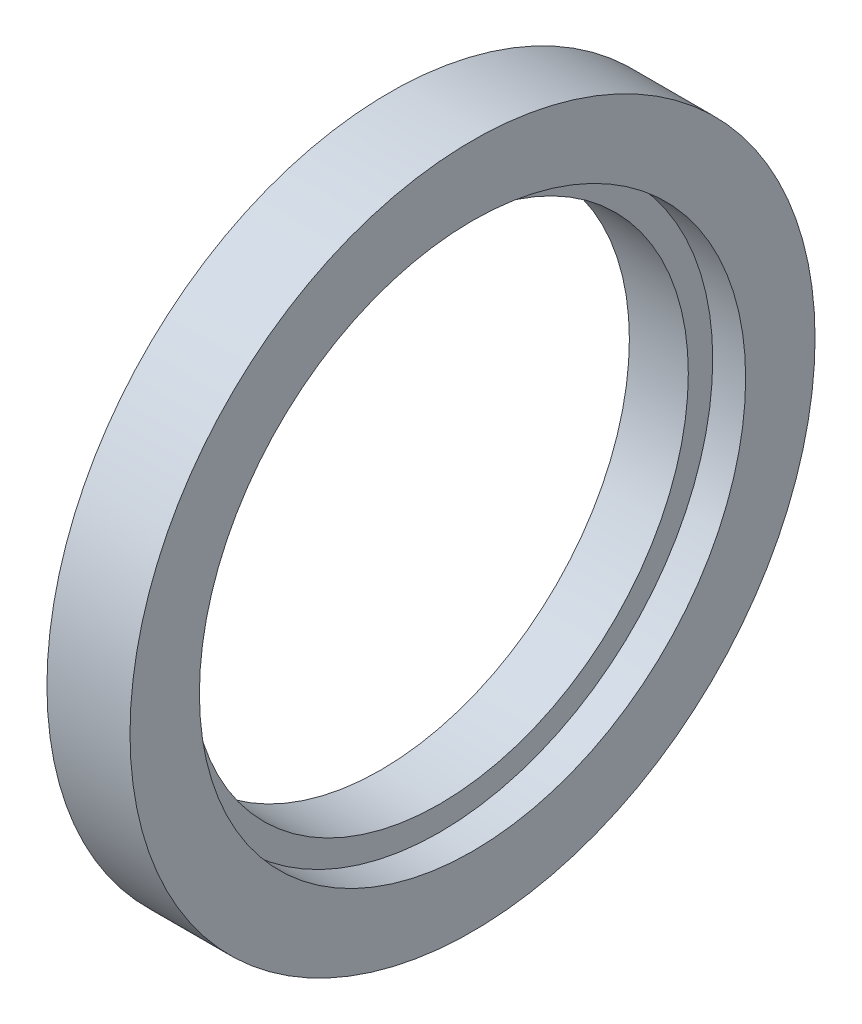
ISO-10303-21;
HEADER;
FILE_DESCRIPTION(('STEP AP214'),'2;1');
FILE_NAME('part.step','',(''),(''),'','','');
FILE_SCHEMA(('AUTOMOTIVE_DESIGN { 1 0 10303 214 1 1 1 1 }'));
ENDSEC;
DATA;
#1=APPLICATION_CONTEXT('core data for automotive mechanical design processes');
#2=APPLICATION_PROTOCOL_DEFINITION('international standard','automotive_design',2000,#1);
#3=PRODUCT_CONTEXT('',#1,'mechanical');
#4=PRODUCT('Part','Part','',(#3));
#5=PRODUCT_RELATED_PRODUCT_CATEGORY('part','',(#4));
#6=PRODUCT_DEFINITION_FORMATION('','',#4);
#7=PRODUCT_DEFINITION_CONTEXT('part definition',#1,'design');
#8=PRODUCT_DEFINITION('design','',#6,#7);
#9=PRODUCT_DEFINITION_SHAPE('','',#8);
#10=(LENGTH_UNIT() NAMED_UNIT(*) SI_UNIT(.MILLI.,.METRE.));
#11=(NAMED_UNIT(*) PLANE_ANGLE_UNIT() SI_UNIT($,.RADIAN.));
#12=(NAMED_UNIT(*) SI_UNIT($,.STERADIAN.) SOLID_ANGLE_UNIT());
#13=UNCERTAINTY_MEASURE_WITH_UNIT(LENGTH_MEASURE(1.E-05),#10,'distance_accuracy_value','');
#14=(GEOMETRIC_REPRESENTATION_CONTEXT(3) GLOBAL_UNCERTAINTY_ASSIGNED_CONTEXT((#13)) GLOBAL_UNIT_ASSIGNED_CONTEXT((#10,
#11,#12)) REPRESENTATION_CONTEXT('',''));
#15=CARTESIAN_POINT('',(0.,0.,0.));
#16=DIRECTION('',(0.,0.,1.));
#17=DIRECTION('',(1.,0.,0.));
#18=AXIS2_PLACEMENT_3D('',#15,#16,#17);
#19=CARTESIAN_POINT('',(2.0692999999999,0.,0.));
#20=DIRECTION('',(1.,0.,0.));
#21=DIRECTION('',(0.,0.,-1.));
#22=AXIS2_PLACEMENT_3D('',#19,#20,#21);
#23=CYLINDRICAL_SURFACE('',#22,17.4624999999999);
#24=CARTESIAN_POINT('',(4.13859999999983,0.,0.));
#25=DIRECTION('',(1.,0.,0.));
#26=DIRECTION('',(0.,0.,-1.));
#27=AXIS2_PLACEMENT_3D('',#24,#25,#26);
#28=CIRCLE('',#27,17.4624999999999);
#29=CARTESIAN_POINT('',(4.13859999999983,0.,-17.4624999999999));
#30=VERTEX_POINT('',#29);
#31=EDGE_CURVE('E18',#30,#30,#28,.F.);
#32=ORIENTED_EDGE('',*,*,#31,.F.);
#33=EDGE_LOOP('',(#32));
#34=FACE_BOUND('',#33,.T.);
#35=CARTESIAN_POINT('',(0.,0.,0.));
#36=DIRECTION('',(1.,0.,0.));
#37=DIRECTION('',(0.,0.,-1.));
#38=AXIS2_PLACEMENT_3D('',#35,#36,#37);
#39=CIRCLE('',#38,17.4624999999999);
#40=CARTESIAN_POINT('',(0.,0.,-17.4624999999999));
#41=VERTEX_POINT('',#40);
#42=EDGE_CURVE('E44',#41,#41,#39,.T.);
#43=ORIENTED_EDGE('',*,*,#42,.F.);
#44=EDGE_LOOP('',(#43));
#45=FACE_BOUND('',#44,.T.);
#46=ADVANCED_FACE('F15',(#34,#45),#23,.F.);
#47=CARTESIAN_POINT('',(4.13859999999983,18.3197499999999,0.));
#48=DIRECTION('',(1.,0.,0.));
#49=DIRECTION('',(0.,0.,-1.));
#50=AXIS2_PLACEMENT_3D('',#47,#48,#49);
#51=PLANE('',#50);
#52=ORIENTED_EDGE('',*,*,#31,.T.);
#53=EDGE_LOOP('',(#52));
#54=FACE_BOUND('',#53,.T.);
#55=CARTESIAN_POINT('',(4.13859999999983,0.,0.));
#56=DIRECTION('',(1.,0.,0.));
#57=DIRECTION('',(0.,0.,-1.));
#58=AXIS2_PLACEMENT_3D('',#55,#56,#57);
#59=CIRCLE('',#58,19.1769999999999);
#60=CARTESIAN_POINT('',(4.13859999999983,0.,-19.1769999999999));
#61=VERTEX_POINT('',#60);
#62=EDGE_CURVE('E42',#61,#61,#59,.T.);
#63=ORIENTED_EDGE('',*,*,#62,.T.);
#64=EDGE_LOOP('',(#63));
#65=FACE_BOUND('',#64,.T.);
#66=ADVANCED_FACE('F51',(#54,#65),#51,.T.);
#67=CARTESIAN_POINT('',(0.,19.2062500000005,0.));
#68=DIRECTION('',(-1.,0.,0.));
#69=DIRECTION('',(0.,0.,1.));
#70=AXIS2_PLACEMENT_3D('',#67,#68,#69);
#71=PLANE('',#70);
#72=ORIENTED_EDGE('',*,*,#42,.T.);
#73=EDGE_LOOP('',(#72));
#74=FACE_BOUND('',#73,.T.);
#75=CARTESIAN_POINT('',(0.,0.,0.));
#76=DIRECTION('',(1.,0.,0.));
#77=DIRECTION('',(0.,0.,-1.));
#78=AXIS2_PLACEMENT_3D('',#75,#76,#77);
#79=CIRCLE('',#78,20.950000000001);
#80=CARTESIAN_POINT('',(0.,0.,-20.950000000001));
#81=VERTEX_POINT('',#80);
#82=EDGE_CURVE('E39',#81,#81,#79,.F.);
#83=ORIENTED_EDGE('',*,*,#82,.T.);
#84=EDGE_LOOP('',(#83));
#85=FACE_BOUND('',#84,.T.);
#86=ADVANCED_FACE('F60',(#74,#85),#71,.T.);
#87=CARTESIAN_POINT('',(5.29429999999922,0.,0.));
#88=DIRECTION('',(1.,0.,0.));
#89=DIRECTION('',(0.,0.,-1.));
#90=AXIS2_PLACEMENT_3D('',#87,#88,#89);
#91=CYLINDRICAL_SURFACE('',#90,19.1769999999999);
#92=CARTESIAN_POINT('',(6.44999999999861,0.,0.));
#93=DIRECTION('',(1.,0.,0.));
#94=DIRECTION('',(0.,0.,-1.));
#95=AXIS2_PLACEMENT_3D('',#92,#93,#94);
#96=CIRCLE('',#95,19.1769999999999);
#97=CARTESIAN_POINT('',(6.44999999999861,0.,-19.1769999999999));
#98=VERTEX_POINT('',#97);
#99=EDGE_CURVE('E34',#98,#98,#96,.F.);
#100=ORIENTED_EDGE('',*,*,#99,.F.);
#101=EDGE_LOOP('',(#100));
#102=FACE_BOUND('',#101,.T.);
#103=ORIENTED_EDGE('',*,*,#62,.F.);
#104=EDGE_LOOP('',(#103));
#105=FACE_BOUND('',#104,.T.);
#106=ADVANCED_FACE('F79',(#102,#105),#91,.F.);
#107=CARTESIAN_POINT('',(-0.255000000000098,0.,0.));
#108=DIRECTION('',(1.,0.,0.));
#109=DIRECTION('',(0.,0.,-1.));
#110=AXIS2_PLACEMENT_3D('',#107,#108,#109);
#111=CYLINDRICAL_SURFACE('',#110,20.950000000001);
#112=ORIENTED_EDGE('',*,*,#82,.F.);
#113=EDGE_LOOP('',(#112));
#114=FACE_BOUND('',#113,.T.);
#115=CARTESIAN_POINT('',(-0.510000002164026,0.,0.));
#116=DIRECTION('',(1.,0.,0.));
#117=DIRECTION('',(0.,1.,0.));
#118=AXIS2_PLACEMENT_3D('',#115,#116,#117);
#119=CIRCLE('',#118,20.9500000007886);
#120=CARTESIAN_POINT('',(-0.510000002164026,20.9500000007886,0.));
#121=VERTEX_POINT('',#120);
#122=EDGE_CURVE('E27',#121,#121,#119,.T.);
#123=ORIENTED_EDGE('',*,*,#122,.F.);
#124=EDGE_LOOP('',(#123));
#125=FACE_BOUND('',#124,.T.);
#126=ADVANCED_FACE('F75',(#114,#125),#111,.F.);
#127=CARTESIAN_POINT('',(6.44999999999861,21.6135000000001,0.));
#128=DIRECTION('',(1.,0.,0.));
#129=DIRECTION('',(0.,0.,-1.));
#130=AXIS2_PLACEMENT_3D('',#127,#128,#129);
#131=PLANE('',#130);
#132=ORIENTED_EDGE('',*,*,#99,.T.);
#133=EDGE_LOOP('',(#132));
#134=FACE_BOUND('',#133,.T.);
#135=CARTESIAN_POINT('',(6.44999999999861,0.,0.));
#136=DIRECTION('',(1.,0.,0.));
#137=DIRECTION('',(0.,0.,-1.));
#138=AXIS2_PLACEMENT_3D('',#135,#136,#137);
#139=CIRCLE('',#138,24.0500000000003);
#140=CARTESIAN_POINT('',(6.44999999999861,0.,-24.0500000000003));
#141=VERTEX_POINT('',#140);
#142=EDGE_CURVE('E22',#141,#141,#139,.F.);
#143=ORIENTED_EDGE('',*,*,#142,.F.);
#144=EDGE_LOOP('',(#143));
#145=FACE_BOUND('',#144,.T.);
#146=ADVANCED_FACE('F68',(#134,#145),#131,.T.);
#147=CARTESIAN_POINT('',(0.618307728388946,0.,0.));
#148=DIRECTION('',(1.,0.,0.));
#149=DIRECTION('',(0.,0.,-1.));
#150=AXIS2_PLACEMENT_3D('',#147,#148,#149);
#151=CONICAL_SURFACE('',#150,24.0499999992128,1.22173047499991);
#152=ORIENTED_EDGE('',*,*,#122,.T.);
#153=EDGE_LOOP('',(#152));
#154=FACE_BOUND('',#153,.T.);
#155=CARTESIAN_POINT('',(0.618307726225102,0.,0.));
#156=DIRECTION('',(1.,0.,0.));
#157=DIRECTION('',(0.,0.,-1.));
#158=AXIS2_PLACEMENT_3D('',#155,#156,#157);
#159=CIRCLE('',#158,24.0500000000003);
#160=CARTESIAN_POINT('',(0.618307726225102,0.,-24.0500000000003));
#161=VERTEX_POINT('',#160);
#162=EDGE_CURVE('E10',#161,#161,#159,.T.);
#163=ORIENTED_EDGE('',*,*,#162,.F.);
#164=EDGE_LOOP('',(#163));
#165=FACE_BOUND('',#164,.T.);
#166=ADVANCED_FACE('F63',(#154,#165),#151,.T.);
#167=CARTESIAN_POINT('',(3.53415386311184,0.,0.));
#168=DIRECTION('',(1.,0.,0.));
#169=DIRECTION('',(0.,0.,-1.));
#170=AXIS2_PLACEMENT_3D('',#167,#168,#169);
#171=CYLINDRICAL_SURFACE('',#170,24.0500000000003);
#172=ORIENTED_EDGE('',*,*,#162,.T.);
#173=EDGE_LOOP('',(#172));
#174=FACE_BOUND('',#173,.T.);
#175=ORIENTED_EDGE('',*,*,#142,.T.);
#176=EDGE_LOOP('',(#175));
#177=FACE_BOUND('',#176,.T.);
#178=ADVANCED_FACE('F61',(#174,#177),#171,.T.);
#179=CLOSED_SHELL('',(#46,#66,#86,#106,#126,#146,#166,#178));
#180=MANIFOLD_SOLID_BREP('B1',#179);
#181=ADVANCED_BREP_SHAPE_REPRESENTATION('',(#18,#180),#14);
#182=SHAPE_DEFINITION_REPRESENTATION(#9,#181);
ENDSEC;
END-ISO-10303-21;
